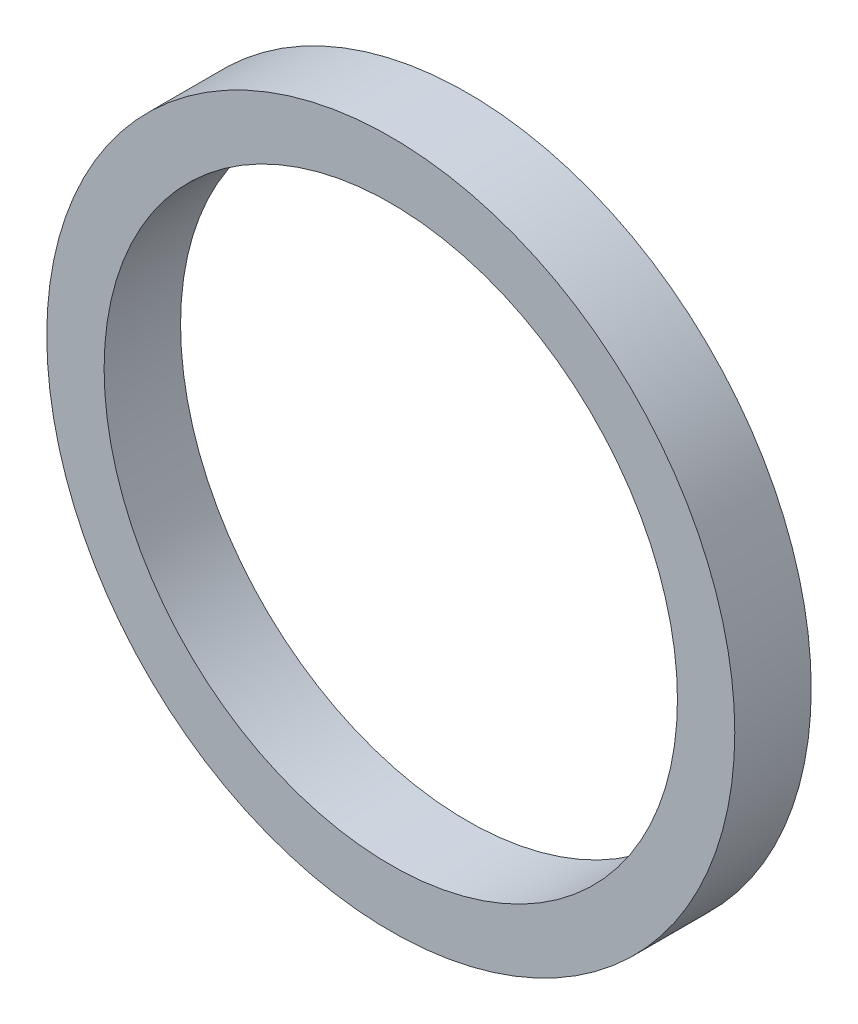
ISO-10303-21;
HEADER;
FILE_DESCRIPTION(('STEP AP214'),'2;1');
FILE_NAME('part.step','',(''),(''),'','','');
FILE_SCHEMA(('AUTOMOTIVE_DESIGN { 1 0 10303 214 1 1 1 1 }'));
ENDSEC;
DATA;
#1=APPLICATION_CONTEXT('core data for automotive mechanical design processes');
#2=APPLICATION_PROTOCOL_DEFINITION('international standard','automotive_design',2000,#1);
#3=PRODUCT_CONTEXT('',#1,'mechanical');
#4=PRODUCT('Part','Part','',(#3));
#5=PRODUCT_RELATED_PRODUCT_CATEGORY('part','',(#4));
#6=PRODUCT_DEFINITION_FORMATION('','',#4);
#7=PRODUCT_DEFINITION_CONTEXT('part definition',#1,'design');
#8=PRODUCT_DEFINITION('design','',#6,#7);
#9=PRODUCT_DEFINITION_SHAPE('','',#8);
#10=(LENGTH_UNIT() NAMED_UNIT(*) SI_UNIT(.MILLI.,.METRE.));
#11=(NAMED_UNIT(*) PLANE_ANGLE_UNIT() SI_UNIT($,.RADIAN.));
#12=(NAMED_UNIT(*) SI_UNIT($,.STERADIAN.) SOLID_ANGLE_UNIT());
#13=UNCERTAINTY_MEASURE_WITH_UNIT(LENGTH_MEASURE(1.E-05),#10,'distance_accuracy_value','');
#14=(GEOMETRIC_REPRESENTATION_CONTEXT(3) GLOBAL_UNCERTAINTY_ASSIGNED_CONTEXT((#13)) GLOBAL_UNIT_ASSIGNED_CONTEXT((#10,
#11,#12)) REPRESENTATION_CONTEXT('',''));
#15=CARTESIAN_POINT('',(0.,0.,0.));
#16=DIRECTION('',(0.,0.,1.));
#17=DIRECTION('',(1.,0.,0.));
#18=AXIS2_PLACEMENT_3D('',#15,#16,#17);
#19=CARTESIAN_POINT('',(0.,0.,0.635));
#20=DIRECTION('',(0.,0.,1.));
#21=DIRECTION('',(1.,0.,0.));
#22=AXIS2_PLACEMENT_3D('',#19,#20,#21);
#23=PLANE('',#22);
#24=CARTESIAN_POINT('',(0.,0.,0.635));
#25=DIRECTION('',(0.,0.,1.));
#26=DIRECTION('',(1.,0.,0.));
#27=AXIS2_PLACEMENT_3D('',#24,#25,#26);
#28=CIRCLE('',#27,2.8575);
#29=CARTESIAN_POINT('',(2.8575,0.,0.635));
#30=VERTEX_POINT('',#29);
#31=EDGE_CURVE('E10',#30,#30,#28,.T.);
#32=ORIENTED_EDGE('',*,*,#31,.T.);
#33=EDGE_LOOP('',(#32));
#34=FACE_BOUND('',#33,.T.);
#35=CARTESIAN_POINT('',(0.,0.,0.635));
#36=DIRECTION('',(0.,0.,1.));
#37=DIRECTION('',(1.,0.,0.));
#38=AXIS2_PLACEMENT_3D('',#35,#36,#37);
#39=CIRCLE('',#38,2.38125);
#40=CARTESIAN_POINT('',(2.38125,0.,0.635));
#41=VERTEX_POINT('',#40);
#42=EDGE_CURVE('E40',#41,#41,#39,.T.);
#43=ORIENTED_EDGE('',*,*,#42,.F.);
#44=EDGE_LOOP('',(#43));
#45=FACE_BOUND('',#44,.T.);
#46=ADVANCED_FACE('F29',(#34,#45),#23,.T.);
#47=CARTESIAN_POINT('',(0.,0.,0.));
#48=DIRECTION('',(0.,0.,1.));
#49=DIRECTION('',(1.,0.,0.));
#50=AXIS2_PLACEMENT_3D('',#47,#48,#49);
#51=PLANE('',#50);
#52=CARTESIAN_POINT('',(0.,0.,0.));
#53=DIRECTION('',(0.,0.,1.));
#54=DIRECTION('',(1.,0.,0.));
#55=AXIS2_PLACEMENT_3D('',#52,#53,#54);
#56=CIRCLE('',#55,2.8575);
#57=CARTESIAN_POINT('',(2.8575,0.,0.));
#58=VERTEX_POINT('',#57);
#59=EDGE_CURVE('E33',#58,#58,#56,.T.);
#60=ORIENTED_EDGE('',*,*,#59,.F.);
#61=EDGE_LOOP('',(#60));
#62=FACE_BOUND('',#61,.T.);
#63=CARTESIAN_POINT('',(0.,0.,0.));
#64=DIRECTION('',(0.,0.,1.));
#65=DIRECTION('',(1.,0.,0.));
#66=AXIS2_PLACEMENT_3D('',#63,#64,#65);
#67=CIRCLE('',#66,2.38125);
#68=CARTESIAN_POINT('',(2.38125,0.,0.));
#69=VERTEX_POINT('',#68);
#70=EDGE_CURVE('E42',#69,#69,#67,.T.);
#71=ORIENTED_EDGE('',*,*,#70,.T.);
#72=EDGE_LOOP('',(#71));
#73=FACE_BOUND('',#72,.T.);
#74=ADVANCED_FACE('F52',(#62,#73),#51,.F.);
#75=CARTESIAN_POINT('',(0.,0.,0.635));
#76=DIRECTION('',(0.,0.,-1.));
#77=DIRECTION('',(-1.,0.,0.));
#78=AXIS2_PLACEMENT_3D('',#75,#76,#77);
#79=CYLINDRICAL_SURFACE('',#78,2.8575);
#80=ORIENTED_EDGE('',*,*,#31,.F.);
#81=EDGE_LOOP('',(#80));
#82=FACE_BOUND('',#81,.T.);
#83=ORIENTED_EDGE('',*,*,#59,.T.);
#84=EDGE_LOOP('',(#83));
#85=FACE_BOUND('',#84,.T.);
#86=ADVANCED_FACE('F31',(#82,#85),#79,.T.);
#87=CARTESIAN_POINT('',(0.,0.,0.635));
#88=DIRECTION('',(0.,0.,-1.));
#89=DIRECTION('',(-1.,0.,0.));
#90=AXIS2_PLACEMENT_3D('',#87,#88,#89);
#91=CYLINDRICAL_SURFACE('',#90,2.38125);
#92=ORIENTED_EDGE('',*,*,#42,.T.);
#93=EDGE_LOOP('',(#92));
#94=FACE_BOUND('',#93,.T.);
#95=ORIENTED_EDGE('',*,*,#70,.F.);
#96=EDGE_LOOP('',(#95));
#97=FACE_BOUND('',#96,.T.);
#98=ADVANCED_FACE('F48',(#94,#97),#91,.F.);
#99=CLOSED_SHELL('',(#46,#74,#86,#98));
#100=MANIFOLD_SOLID_BREP('B2',#99);
#101=ADVANCED_BREP_SHAPE_REPRESENTATION('',(#18,#100),#14);
#102=SHAPE_DEFINITION_REPRESENTATION(#9,#101);
ENDSEC;
END-ISO-10303-21;
